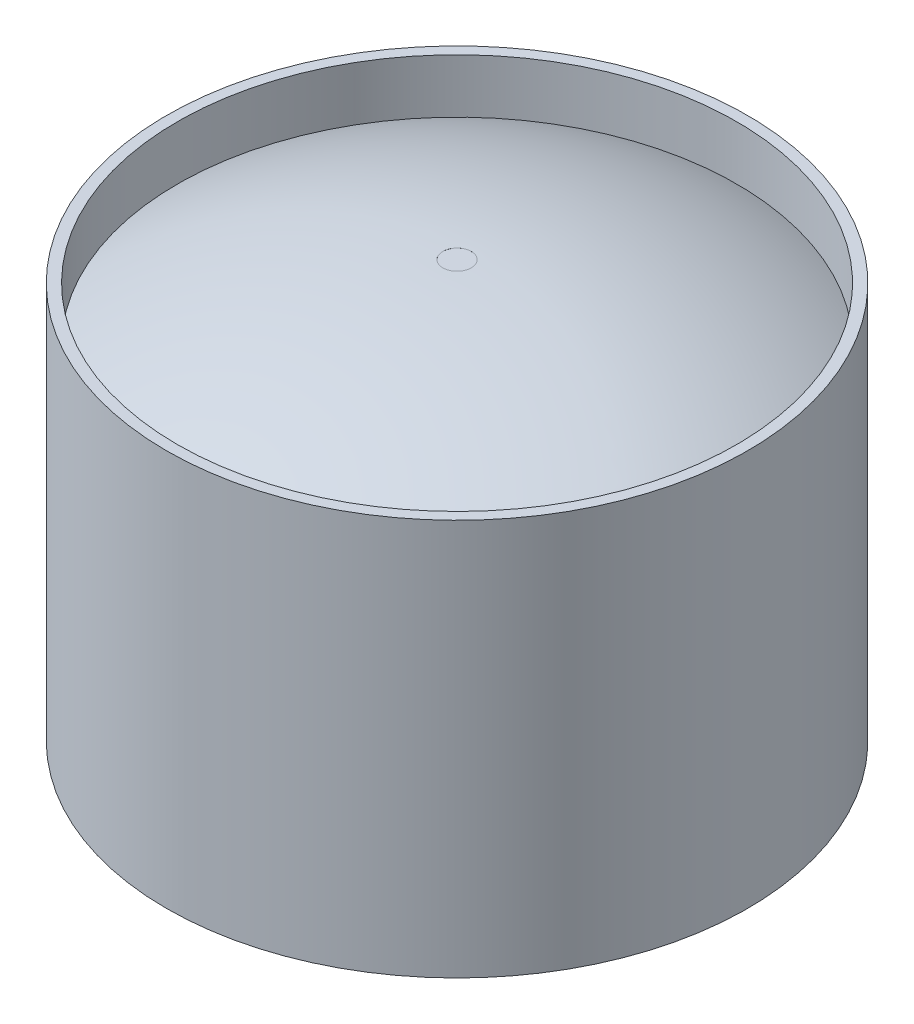
ISO-10303-21;
HEADER;
FILE_DESCRIPTION(('STEP AP214'),'2;1');
FILE_NAME('part.step','',(''),(''),'','','');
FILE_SCHEMA(('AUTOMOTIVE_DESIGN { 1 0 10303 214 1 1 1 1 }'));
ENDSEC;
DATA;
#1=APPLICATION_CONTEXT('core data for automotive mechanical design processes');
#2=APPLICATION_PROTOCOL_DEFINITION('international standard','automotive_design',2000,#1);
#3=PRODUCT_CONTEXT('',#1,'mechanical');
#4=PRODUCT('Part','Part','',(#3));
#5=PRODUCT_RELATED_PRODUCT_CATEGORY('part','',(#4));
#6=PRODUCT_DEFINITION_FORMATION('','',#4);
#7=PRODUCT_DEFINITION_CONTEXT('part definition',#1,'design');
#8=PRODUCT_DEFINITION('design','',#6,#7);
#9=PRODUCT_DEFINITION_SHAPE('','',#8);
#10=(LENGTH_UNIT() NAMED_UNIT(*) SI_UNIT(.MILLI.,.METRE.));
#11=(NAMED_UNIT(*) PLANE_ANGLE_UNIT() SI_UNIT($,.RADIAN.));
#12=(NAMED_UNIT(*) SI_UNIT($,.STERADIAN.) SOLID_ANGLE_UNIT());
#13=UNCERTAINTY_MEASURE_WITH_UNIT(LENGTH_MEASURE(1.E-05),#10,'distance_accuracy_value','');
#14=(GEOMETRIC_REPRESENTATION_CONTEXT(3) GLOBAL_UNCERTAINTY_ASSIGNED_CONTEXT((#13)) GLOBAL_UNIT_ASSIGNED_CONTEXT((#10,
#11,#12)) REPRESENTATION_CONTEXT('',''));
#15=CARTESIAN_POINT('',(0.,0.,0.));
#16=DIRECTION('',(0.,0.,1.));
#17=DIRECTION('',(1.,0.,0.));
#18=AXIS2_PLACEMENT_3D('',#15,#16,#17);
#19=CARTESIAN_POINT('',(0.,5.5,0.));
#20=DIRECTION('',(0.,-1.,0.));
#21=DIRECTION('',(0.,0.,-1.));
#22=AXIS2_PLACEMENT_3D('',#19,#20,#21);
#23=CYLINDRICAL_SURFACE('',#22,3.88065);
#24=CARTESIAN_POINT('',(0.,0.,0.));
#25=DIRECTION('',(0.,1.,0.));
#26=DIRECTION('',(0.,0.,1.));
#27=AXIS2_PLACEMENT_3D('',#24,#25,#26);
#28=CIRCLE('',#27,3.88065);
#29=CARTESIAN_POINT('',(0.,0.,3.88065));
#30=VERTEX_POINT('',#29);
#31=EDGE_CURVE('E45',#30,#30,#28,.T.);
#32=ORIENTED_EDGE('',*,*,#31,.F.);
#33=EDGE_LOOP('',(#32));
#34=FACE_BOUND('',#33,.T.);
#35=CARTESIAN_POINT('',(0.,0.75,0.));
#36=DIRECTION('',(0.,1.,0.));
#37=DIRECTION('',(0.,0.,1.));
#38=AXIS2_PLACEMENT_3D('',#35,#36,#37);
#39=CIRCLE('',#38,3.88065);
#40=CARTESIAN_POINT('',(0.,0.75,3.88065));
#41=VERTEX_POINT('',#40);
#42=EDGE_CURVE('E56',#41,#41,#39,.T.);
#43=ORIENTED_EDGE('',*,*,#42,.T.);
#44=EDGE_LOOP('',(#43));
#45=FACE_BOUND('',#44,.T.);
#46=ADVANCED_FACE('F32',(#34,#45),#23,.F.);
#47=CARTESIAN_POINT('',(0.,5.5,0.));
#48=DIRECTION('',(0.,1.,0.));
#49=DIRECTION('',(0.,0.,1.));
#50=AXIS2_PLACEMENT_3D('',#47,#48,#49);
#51=CIRCLE('',#50,3.88065);
#52=CARTESIAN_POINT('',(0.,5.5,3.88065));
#53=VERTEX_POINT('',#52);
#54=EDGE_CURVE('E43',#53,#53,#51,.T.);
#55=ORIENTED_EDGE('',*,*,#54,.T.);
#56=EDGE_LOOP('',(#55));
#57=FACE_BOUND('',#56,.T.);
#58=CARTESIAN_POINT('',(0.,4.75,0.));
#59=DIRECTION('',(0.,1.,0.));
#60=DIRECTION('',(0.,0.,1.));
#61=AXIS2_PLACEMENT_3D('',#58,#59,#60);
#62=CIRCLE('',#61,3.88065);
#63=CARTESIAN_POINT('',(0.,4.75,3.88065));
#64=VERTEX_POINT('',#63);
#65=EDGE_CURVE('E53',#64,#64,#62,.T.);
#66=ORIENTED_EDGE('',*,*,#65,.F.);
#67=EDGE_LOOP('',(#66));
#68=FACE_BOUND('',#67,.T.);
#69=ADVANCED_FACE('F83',(#57,#68),#23,.F.);
#70=CARTESIAN_POINT('',(0.,5.5,0.));
#71=DIRECTION('',(0.,1.,0.));
#72=DIRECTION('',(0.,0.,1.));
#73=AXIS2_PLACEMENT_3D('',#70,#71,#72);
#74=PLANE('',#73);
#75=CARTESIAN_POINT('',(0.,5.5,0.));
#76=DIRECTION('',(0.,1.,0.));
#77=DIRECTION('',(0.,0.,1.));
#78=AXIS2_PLACEMENT_3D('',#75,#76,#77);
#79=CIRCLE('',#78,4.03065);
#80=CARTESIAN_POINT('',(0.,5.5,4.03065));
#81=VERTEX_POINT('',#80);
#82=EDGE_CURVE('E10',#81,#81,#79,.T.);
#83=ORIENTED_EDGE('',*,*,#82,.T.);
#84=EDGE_LOOP('',(#83));
#85=FACE_BOUND('',#84,.T.);
#86=ORIENTED_EDGE('',*,*,#54,.F.);
#87=EDGE_LOOP('',(#86));
#88=FACE_BOUND('',#87,.T.);
#89=ADVANCED_FACE('F89',(#85,#88),#74,.T.);
#90=CARTESIAN_POINT('',(0.,0.,0.));
#91=DIRECTION('',(0.,1.,0.));
#92=DIRECTION('',(0.,0.,1.));
#93=AXIS2_PLACEMENT_3D('',#90,#91,#92);
#94=PLANE('',#93);
#95=CARTESIAN_POINT('',(0.,0.,0.));
#96=DIRECTION('',(0.,1.,0.));
#97=DIRECTION('',(0.,0.,1.));
#98=AXIS2_PLACEMENT_3D('',#95,#96,#97);
#99=CIRCLE('',#98,4.03065);
#100=CARTESIAN_POINT('',(0.,0.,4.03065));
#101=VERTEX_POINT('',#100);
#102=EDGE_CURVE('E36',#101,#101,#99,.T.);
#103=ORIENTED_EDGE('',*,*,#102,.F.);
#104=EDGE_LOOP('',(#103));
#105=FACE_BOUND('',#104,.T.);
#106=ORIENTED_EDGE('',*,*,#31,.T.);
#107=EDGE_LOOP('',(#106));
#108=FACE_BOUND('',#107,.T.);
#109=ADVANCED_FACE('F97',(#105,#108),#94,.F.);
#110=CARTESIAN_POINT('',(0.,5.5,0.));
#111=DIRECTION('',(0.,-1.,0.));
#112=DIRECTION('',(0.,0.,-1.));
#113=AXIS2_PLACEMENT_3D('',#110,#111,#112);
#114=CYLINDRICAL_SURFACE('',#113,4.03065);
#115=ORIENTED_EDGE('',*,*,#82,.F.);
#116=EDGE_LOOP('',(#115));
#117=FACE_BOUND('',#116,.T.);
#118=ORIENTED_EDGE('',*,*,#102,.T.);
#119=EDGE_LOOP('',(#118));
#120=FACE_BOUND('',#119,.T.);
#121=ADVANCED_FACE('F34',(#117,#120),#114,.T.);
#122=CARTESIAN_POINT('',(0.,11.9687959603956,0.));
#123=DIRECTION('',(0.,1.,0.));
#124=DIRECTION('',(0.,0.,1.));
#125=AXIS2_PLACEMENT_3D('',#122,#123,#124);
#126=DEGENERATE_TOROIDAL_SURFACE('',#125,0.321757309872835,11.9800505006891,.F.);
#127=ORIENTED_EDGE('',*,*,#42,.F.);
#128=EDGE_LOOP('',(#127));
#129=FACE_BOUND('',#128,.T.);
#130=CARTESIAN_POINT('',(0.,0.,0.));
#131=DIRECTION('',(0.,1.,0.));
#132=DIRECTION('',(0.,0.,1.));
#133=AXIS2_PLACEMENT_3D('',#130,#131,#132);
#134=CIRCLE('',#133,0.197408614932766);
#135=CARTESIAN_POINT('',(0.,0.,0.197408614932766));
#136=VERTEX_POINT('',#135);
#137=EDGE_CURVE('E62',#136,#136,#134,.T.);
#138=ORIENTED_EDGE('',*,*,#137,.T.);
#139=EDGE_LOOP('',(#138));
#140=FACE_BOUND('',#139,.T.);
#141=ADVANCED_FACE('F66',(#129,#140),#126,.F.);
#142=CARTESIAN_POINT('',(0.,5.5,0.));
#143=DIRECTION('',(0.,1.,0.));
#144=DIRECTION('',(0.,0.,1.));
#145=AXIS2_PLACEMENT_3D('',#142,#143,#144);
#146=CYLINDRICAL_SURFACE('',#145,0.197408614932766);
#147=CARTESIAN_POINT('',(0.,5.78159739039631,0.));
#148=DIRECTION('',(0.,1.,0.));
#149=DIRECTION('',(0.,0.,1.));
#150=AXIS2_PLACEMENT_3D('',#147,#148,#149);
#151=CIRCLE('',#150,0.197408614932766);
#152=CARTESIAN_POINT('',(0.,5.78159739039631,0.197408614932766));
#153=VERTEX_POINT('',#152);
#154=EDGE_CURVE('E59',#153,#153,#151,.T.);
#155=ORIENTED_EDGE('',*,*,#154,.F.);
#156=EDGE_LOOP('',(#155));
#157=FACE_BOUND('',#156,.T.);
#158=CARTESIAN_POINT('',(0.,5.78191747129151,0.));
#159=DIRECTION('',(0.,1.,0.));
#160=DIRECTION('',(0.,0.,1.));
#161=AXIS2_PLACEMENT_3D('',#158,#159,#160);
#162=CIRCLE('',#161,0.197408614932766);
#163=CARTESIAN_POINT('',(0.,5.78191747129151,0.197408614932766));
#164=VERTEX_POINT('',#163);
#165=EDGE_CURVE('E48',#164,#164,#162,.T.);
#166=ORIENTED_EDGE('',*,*,#165,.T.);
#167=EDGE_LOOP('',(#166));
#168=FACE_BOUND('',#167,.T.);
#169=ADVANCED_FACE('F79',(#157,#168),#146,.F.);
#170=CARTESIAN_POINT('',(0.,-1.65013498434125,0.));
#171=DIRECTION('',(0.,1.,0.));
#172=DIRECTION('',(0.,0.,1.));
#173=AXIS2_PLACEMENT_3D('',#170,#171,#172);
#174=DEGENERATE_TOROIDAL_SURFACE('',#173,0.101377875855463,7.43267284401276,.T.);
#175=ORIENTED_EDGE('',*,*,#165,.F.);
#176=EDGE_LOOP('',(#175));
#177=FACE_BOUND('',#176,.T.);
#178=ORIENTED_EDGE('',*,*,#65,.T.);
#179=EDGE_LOOP('',(#178));
#180=FACE_BOUND('',#179,.T.);
#181=ADVANCED_FACE('F71',(#177,#180),#174,.T.);
#182=CARTESIAN_POINT('',(0.,0.,0.));
#183=DIRECTION('',(0.,1.,0.));
#184=DIRECTION('',(0.,0.,1.));
#185=AXIS2_PLACEMENT_3D('',#182,#183,#184);
#186=PLANE('',#185);
#187=ORIENTED_EDGE('',*,*,#137,.F.);
#188=EDGE_LOOP('',(#187));
#189=FACE_BOUND('',#188,.T.);
#190=ADVANCED_FACE('F68',(#189),#186,.F.);
#191=CARTESIAN_POINT('',(0.,5.78159739039631,0.));
#192=DIRECTION('',(0.,1.,0.));
#193=DIRECTION('',(0.,0.,1.));
#194=AXIS2_PLACEMENT_3D('',#191,#192,#193);
#195=PLANE('',#194);
#196=ORIENTED_EDGE('',*,*,#154,.T.);
#197=EDGE_LOOP('',(#196));
#198=FACE_BOUND('',#197,.T.);
#199=ADVANCED_FACE('F70',(#198),#195,.T.);
#200=CLOSED_SHELL('',(#46,#69,#89,#109,#121,#141,#169,#181,#190,#199));
#201=MANIFOLD_SOLID_BREP('B2',#200);
#202=ADVANCED_BREP_SHAPE_REPRESENTATION('',(#18,#201),#14);
#203=SHAPE_DEFINITION_REPRESENTATION(#9,#202);
ENDSEC;
END-ISO-10303-21;
